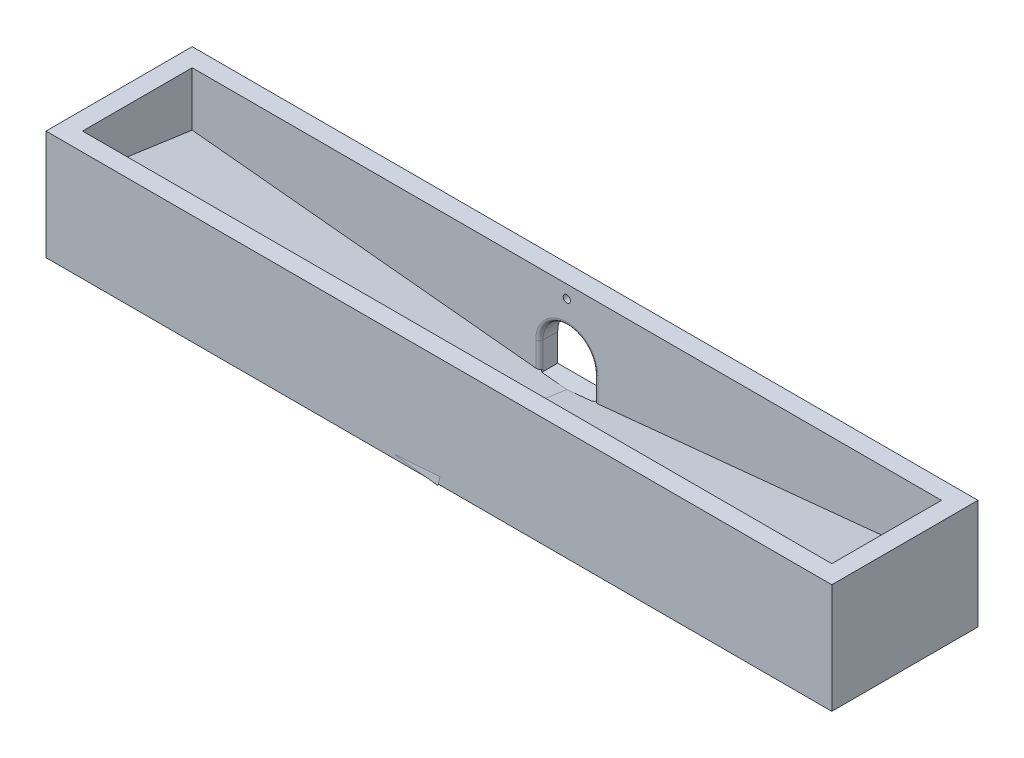
ISO-10303-21;
HEADER;
FILE_DESCRIPTION(('STEP AP214'),'2;1');
FILE_NAME('part.step','',(''),(''),'','','');
FILE_SCHEMA(('AUTOMOTIVE_DESIGN { 1 0 10303 214 1 1 1 1 }'));
ENDSEC;
DATA;
#1=APPLICATION_CONTEXT('core data for automotive mechanical design processes');
#2=APPLICATION_PROTOCOL_DEFINITION('international standard','automotive_design',2000,#1);
#3=PRODUCT_CONTEXT('',#1,'mechanical');
#4=PRODUCT('Part','Part','',(#3));
#5=PRODUCT_RELATED_PRODUCT_CATEGORY('part','',(#4));
#6=PRODUCT_DEFINITION_FORMATION('','',#4);
#7=PRODUCT_DEFINITION_CONTEXT('part definition',#1,'design');
#8=PRODUCT_DEFINITION('design','',#6,#7);
#9=PRODUCT_DEFINITION_SHAPE('','',#8);
#10=(LENGTH_UNIT() NAMED_UNIT(*) SI_UNIT(.MILLI.,.METRE.));
#11=(NAMED_UNIT(*) PLANE_ANGLE_UNIT() SI_UNIT($,.RADIAN.));
#12=(NAMED_UNIT(*) SI_UNIT($,.STERADIAN.) SOLID_ANGLE_UNIT());
#13=UNCERTAINTY_MEASURE_WITH_UNIT(LENGTH_MEASURE(1.E-05),#10,'distance_accuracy_value','');
#14=(GEOMETRIC_REPRESENTATION_CONTEXT(3) GLOBAL_UNCERTAINTY_ASSIGNED_CONTEXT((#13)) GLOBAL_UNIT_ASSIGNED_CONTEXT((#10,
#11,#12)) REPRESENTATION_CONTEXT('',''));
#15=CARTESIAN_POINT('',(0.,0.,0.));
#16=DIRECTION('',(0.,0.,1.));
#17=DIRECTION('',(1.,0.,0.));
#18=AXIS2_PLACEMENT_3D('',#15,#16,#17);
#19=CARTESIAN_POINT('',(5.04655087616473,33.5218987841965,80.));
#20=DIRECTION('',(-0.010162979171878,0.142406644594665,0.98975606157762));
#21=DIRECTION('',(-0.997463139995083,-0.0711848604068987,0.));
#22=AXIS2_PLACEMENT_3D('',#19,#20,#21);
#23=PLANE('',#22);
#24=DIRECTION('',(-0.997463139995083,-0.0711848604068987,0.));
#25=VECTOR('',#24,1.);
#26=CARTESIAN_POINT('',(-7.55437981327096,32.6226219526447,80.));
#27=LINE('',#26,#25);
#28=CARTESIAN_POINT('',(5.04655087616473,33.5218987841965,80.));
#29=VERTEX_POINT('',#28);
#30=CARTESIAN_POINT('',(-20.1553105027066,31.7233451210929,80.));
#31=VERTEX_POINT('',#30);
#32=EDGE_CURVE('E13',#29,#31,#27,.T.);
#33=ORIENTED_EDGE('',*,*,#32,.T.);
#34=DIRECTION('',(0.995115861768251,-0.0957531220203229,0.0239950261635971));
#35=VECTOR('',#34,1.);
#36=CARTESIAN_POINT('',(-7.76285659323286,30.530904927027,80.2988167179454));
#37=LINE('',#36,#35);
#38=CARTESIAN_POINT('',(4.62959731624092,29.338464732961,80.5976334358908));
#39=VERTEX_POINT('',#38);
#40=EDGE_CURVE('E70',#31,#39,#37,.T.);
#41=ORIENTED_EDGE('',*,*,#40,.T.);
#42=DIRECTION('',(0.0981892840971753,0.985165817108325,-0.140737973872618));
#43=VECTOR('',#42,1.);
#44=CARTESIAN_POINT('',(4.83807409620283,31.4301817585788,80.2988167179454));
#45=LINE('',#44,#43);
#46=EDGE_CURVE('E65',#39,#29,#45,.T.);
#47=ORIENTED_EDGE('',*,*,#46,.T.);
#48=EDGE_LOOP('',(#33,#41,#47));
#49=FACE_BOUND('',#48,.T.);
#50=ADVANCED_FACE('F64',(#49),#23,.T.);
#51=OPEN_SHELL('',(#50));
#52=SHELL_BASED_SURFACE_MODEL('B2',(#51));
#53=CARTESIAN_POINT('',(-210.490943755958,29.5662535748332,80.));
#54=DIRECTION('',(0.,1.,0.));
#55=DIRECTION('',(0.,0.,1.));
#56=AXIS2_PLACEMENT_3D('',#53,#54,#55);
#57=PLANE('',#56);
#58=DIRECTION('',(0.,0.,1.));
#59=VECTOR('',#58,1.);
#60=CARTESIAN_POINT('',(26.8697360190398,29.5662535748332,10.));
#61=LINE('',#60,#59);
#62=CARTESIAN_POINT('',(26.8697360190398,29.5662535748332,0.));
#63=VERTEX_POINT('',#62);
#64=CARTESIAN_POINT('',(26.8697360190398,29.5662535748332,10.));
#65=VERTEX_POINT('',#64);
#66=EDGE_CURVE('E118',#63,#65,#61,.T.);
#67=ORIENTED_EDGE('',*,*,#66,.F.);
#68=DIRECTION('',(1.,0.,0.));
#69=VECTOR('',#68,1.);
#70=CARTESIAN_POINT('',(-210.490943755958,29.5662535748332,0.));
#71=LINE('',#70,#69);
#72=CARTESIAN_POINT('',(219.509056244042,29.5662535748332,0.));
#73=VERTEX_POINT('',#72);
#74=EDGE_CURVE('E350',#63,#73,#71,.T.);
#75=ORIENTED_EDGE('',*,*,#74,.T.);
#76=DIRECTION('',(0.,0.,-1.));
#77=VECTOR('',#76,1.);
#78=CARTESIAN_POINT('',(219.509056244042,29.5662535748332,80.));
#79=LINE('',#78,#77);
#80=CARTESIAN_POINT('',(219.509056244042,29.5662535748332,80.));
#81=VERTEX_POINT('',#80);
#82=EDGE_CURVE('E361',#81,#73,#79,.T.);
#83=ORIENTED_EDGE('',*,*,#82,.F.);
#84=DIRECTION('',(1.,0.,0.));
#85=VECTOR('',#84,1.);
#86=CARTESIAN_POINT('',(-210.490943755958,29.5662535748332,80.));
#87=LINE('',#86,#85);
#88=CARTESIAN_POINT('',(-210.490943755958,29.5662535748332,80.));
#89=VERTEX_POINT('',#88);
#90=EDGE_CURVE('E340',#89,#81,#87,.T.);
#91=ORIENTED_EDGE('',*,*,#90,.F.);
#92=DIRECTION('',(0.,0.,-1.));
#93=VECTOR('',#92,1.);
#94=CARTESIAN_POINT('',(-210.490943755958,29.5662535748332,80.));
#95=LINE('',#94,#93);
#96=CARTESIAN_POINT('',(-210.490943755958,29.5662535748332,0.));
#97=VERTEX_POINT('',#96);
#98=EDGE_CURVE('E364',#89,#97,#95,.T.);
#99=ORIENTED_EDGE('',*,*,#98,.T.);
#100=CARTESIAN_POINT('',(-17.851623530956,29.5662535748332,0.));
#101=VERTEX_POINT('',#100);
#102=EDGE_CURVE('E351',#97,#101,#71,.T.);
#103=ORIENTED_EDGE('',*,*,#102,.T.);
#104=DIRECTION('',(0.,0.,-1.));
#105=VECTOR('',#104,1.);
#106=CARTESIAN_POINT('',(-17.851623530956,29.5662535748332,0.));
#107=LINE('',#106,#105);
#108=CARTESIAN_POINT('',(-17.851623530956,29.5662535748332,10.));
#109=VERTEX_POINT('',#108);
#110=EDGE_CURVE('E263',#109,#101,#107,.T.);
#111=ORIENTED_EDGE('',*,*,#110,.F.);
#112=DIRECTION('',(-1.,0.,0.));
#113=VECTOR('',#112,1.);
#114=CARTESIAN_POINT('',(-17.851623530956,29.5662535748332,10.));
#115=LINE('',#114,#113);
#116=EDGE_CURVE('E113',#65,#109,#115,.T.);
#117=ORIENTED_EDGE('',*,*,#116,.F.);
#118=EDGE_LOOP('',(#67,#75,#83,#91,#99,#103,#111,#117));
#119=FACE_BOUND('',#118,.T.);
#120=ADVANCED_FACE('F98',(#119),#57,.F.);
#121=CARTESIAN_POINT('',(-200.490943755958,39.5662535748332,10.));
#122=DIRECTION('',(0.,0.,-1.));
#123=DIRECTION('',(-1.,0.,0.));
#124=AXIS2_PLACEMENT_3D('',#121,#122,#123);
#125=PLANE('',#124);
#126=CARTESIAN_POINT('',(4.50905624404191,82.5662535748332,10.));
#127=DIRECTION('',(0.,0.,-1.));
#128=DIRECTION('',(-1.,0.,0.));
#129=AXIS2_PLACEMENT_3D('',#126,#127,#128);
#130=CIRCLE('',#129,2.);
#131=CARTESIAN_POINT('',(2.50905624404191,82.5662535748332,10.));
#132=VERTEX_POINT('',#131);
#133=EDGE_CURVE('E518',#132,#132,#130,.T.);
#134=ORIENTED_EDGE('',*,*,#133,.T.);
#135=EDGE_LOOP('',(#134));
#136=FACE_BOUND('',#135,.T.);
#137=DIRECTION('',(-0.995069867860061,0.0991763987900393,0.));
#138=VECTOR('',#137,1.);
#139=CARTESIAN_POINT('',(-198.474572350181,59.7971800127956,10.));
#140=LINE('',#139,#138);
#141=CARTESIAN_POINT('',(-12.4909437559582,41.2606057343016,10.));
#142=VERTEX_POINT('',#141);
#143=CARTESIAN_POINT('',(-200.490943755958,59.9981472625408,10.));
#144=VERTEX_POINT('',#143);
#145=EDGE_CURVE('E312',#142,#144,#140,.T.);
#146=ORIENTED_EDGE('',*,*,#145,.F.);
#147=DIRECTION('',(0.,1.,0.));
#148=VECTOR('',#147,1.);
#149=CARTESIAN_POINT('',(-12.4909437559581,39.5662535748332,10.));
#150=LINE('',#149,#148);
#151=CARTESIAN_POINT('',(-12.4909437559581,54.5662535748332,10.));
#152=VERTEX_POINT('',#151);
#153=EDGE_CURVE('E377',#142,#152,#150,.T.);
#154=ORIENTED_EDGE('',*,*,#153,.T.);
#155=CARTESIAN_POINT('',(4.50905624404187,54.5662535748332,10.));
#156=DIRECTION('',(0.,0.,-1.));
#157=DIRECTION('',(-1.,0.,0.));
#158=AXIS2_PLACEMENT_3D('',#155,#156,#157);
#159=CIRCLE('',#158,17.);
#160=CARTESIAN_POINT('',(21.5090562440419,54.5662535748332,10.));
#161=VERTEX_POINT('',#160);
#162=EDGE_CURVE('E375',#152,#161,#159,.T.);
#163=ORIENTED_EDGE('',*,*,#162,.T.);
#164=DIRECTION('',(0.,-1.,0.));
#165=VECTOR('',#164,1.);
#166=CARTESIAN_POINT('',(21.5090562440419,39.5662535748332,10.));
#167=LINE('',#166,#165);
#168=CARTESIAN_POINT('',(21.5090562440418,41.2606057343016,10.));
#169=VERTEX_POINT('',#168);
#170=EDGE_CURVE('E373',#161,#169,#167,.T.);
#171=ORIENTED_EDGE('',*,*,#170,.T.);
#172=DIRECTION('',(-0.995069867860061,-0.0991763987900384,0.));
#173=VECTOR('',#172,1.);
#174=CARTESIAN_POINT('',(-198.474572350181,19.3353271368709,10.));
#175=LINE('',#174,#173);
#176=CARTESIAN_POINT('',(209.509056244042,59.9981472625406,10.));
#177=VERTEX_POINT('',#176);
#178=EDGE_CURVE('E304',#177,#169,#175,.T.);
#179=ORIENTED_EDGE('',*,*,#178,.F.);
#180=DIRECTION('',(0.,1.,0.));
#181=VECTOR('',#180,1.);
#182=CARTESIAN_POINT('',(209.509056244042,39.5662535748332,10.));
#183=LINE('',#182,#181);
#184=CARTESIAN_POINT('',(209.509056244042,89.5662535748332,10.));
#185=VERTEX_POINT('',#184);
#186=EDGE_CURVE('E332',#177,#185,#183,.T.);
#187=ORIENTED_EDGE('',*,*,#186,.T.);
#188=DIRECTION('',(-1.,0.,0.));
#189=VECTOR('',#188,1.);
#190=CARTESIAN_POINT('',(-200.490943755958,89.5662535748332,10.));
#191=LINE('',#190,#189);
#192=CARTESIAN_POINT('',(-200.490943755958,89.5662535748332,10.));
#193=VERTEX_POINT('',#192);
#194=EDGE_CURVE('E325',#185,#193,#191,.T.);
#195=ORIENTED_EDGE('',*,*,#194,.T.);
#196=DIRECTION('',(0.,1.,0.));
#197=VECTOR('',#196,1.);
#198=CARTESIAN_POINT('',(-200.490943755958,39.5662535748332,10.));
#199=LINE('',#198,#197);
#200=EDGE_CURVE('E329',#144,#193,#199,.T.);
#201=ORIENTED_EDGE('',*,*,#200,.F.);
#202=EDGE_LOOP('',(#146,#154,#163,#171,#179,#187,#195,#201));
#203=FACE_BOUND('',#202,.T.);
#204=ADVANCED_FACE('F464',(#136,#203),#125,.F.);
#205=CARTESIAN_POINT('',(0.,0.,80.));
#206=DIRECTION('',(0.,0.,1.));
#207=DIRECTION('',(1.,0.,0.));
#208=AXIS2_PLACEMENT_3D('',#205,#206,#207);
#209=PLANE('',#208);
#210=ORIENTED_EDGE('',*,*,#90,.T.);
#211=DIRECTION('',(0.,1.,0.));
#212=VECTOR('',#211,1.);
#213=CARTESIAN_POINT('',(219.509056244042,89.5662535748332,80.));
#214=LINE('',#213,#212);
#215=CARTESIAN_POINT('',(219.509056244042,89.5662535748332,80.));
#216=VERTEX_POINT('',#215);
#217=EDGE_CURVE('E343',#81,#216,#214,.T.);
#218=ORIENTED_EDGE('',*,*,#217,.T.);
#219=DIRECTION('',(-1.,0.,0.));
#220=VECTOR('',#219,1.);
#221=CARTESIAN_POINT('',(-210.490943755958,89.5662535748332,80.));
#222=LINE('',#221,#220);
#223=CARTESIAN_POINT('',(-210.490943755958,89.5662535748332,80.));
#224=VERTEX_POINT('',#223);
#225=EDGE_CURVE('E345',#216,#224,#222,.T.);
#226=ORIENTED_EDGE('',*,*,#225,.T.);
#227=DIRECTION('',(0.,-1.,0.));
#228=VECTOR('',#227,1.);
#229=CARTESIAN_POINT('',(-210.490943755958,89.5662535748332,80.));
#230=LINE('',#229,#228);
#231=EDGE_CURVE('E337',#224,#89,#230,.T.);
#232=ORIENTED_EDGE('',*,*,#231,.T.);
#233=EDGE_LOOP('',(#210,#218,#226,#232));
#234=FACE_BOUND('',#233,.T.);
#235=ADVANCED_FACE('F504',(#234),#209,.T.);
#236=CARTESIAN_POINT('',(209.509056244042,39.5662535748332,10.));
#237=DIRECTION('',(1.,0.,0.));
#238=DIRECTION('',(0.,0.,-1.));
#239=AXIS2_PLACEMENT_3D('',#236,#237,#238);
#240=PLANE('',#239);
#241=DIRECTION('',(0.,-0.14142135623731,-0.989949493661166));
#242=VECTOR('',#241,1.);
#243=CARTESIAN_POINT('',(209.509056244042,59.5895093887865,7.13953488372095));
#244=LINE('',#243,#242);
#245=CARTESIAN_POINT('',(209.509056244042,68.5695758339693,70.));
#246=VERTEX_POINT('',#245);
#247=EDGE_CURVE('E300',#246,#177,#244,.T.);
#248=ORIENTED_EDGE('',*,*,#247,.F.);
#249=DIRECTION('',(0.,1.,0.));
#250=VECTOR('',#249,1.);
#251=CARTESIAN_POINT('',(209.509056244042,39.5662535748332,70.));
#252=LINE('',#251,#250);
#253=CARTESIAN_POINT('',(209.509056244042,89.5662535748332,70.));
#254=VERTEX_POINT('',#253);
#255=EDGE_CURVE('E334',#246,#254,#252,.T.);
#256=ORIENTED_EDGE('',*,*,#255,.T.);
#257=DIRECTION('',(0.,0.,-1.));
#258=VECTOR('',#257,1.);
#259=CARTESIAN_POINT('',(209.509056244042,89.5662535748332,10.));
#260=LINE('',#259,#258);
#261=EDGE_CURVE('E322',#254,#185,#260,.T.);
#262=ORIENTED_EDGE('',*,*,#261,.T.);
#263=ORIENTED_EDGE('',*,*,#186,.F.);
#264=EDGE_LOOP('',(#248,#256,#262,#263));
#265=FACE_BOUND('',#264,.T.);
#266=ADVANCED_FACE('F459',(#265),#240,.F.);
#267=CARTESIAN_POINT('',(-200.490943755958,39.5662535748332,70.));
#268=DIRECTION('',(0.,0.,1.));
#269=DIRECTION('',(1.,0.,0.));
#270=AXIS2_PLACEMENT_3D('',#267,#268,#269);
#271=PLANE('',#270);
#272=DIRECTION('',(0.995069867860061,0.0991763987900384,0.));
#273=VECTOR('',#272,1.);
#274=CARTESIAN_POINT('',(-199.3204647448,27.8224474962113,70.));
#275=LINE('',#274,#273);
#276=CARTESIAN_POINT('',(4.50905624404194,48.1376821462618,70.));
#277=VERTEX_POINT('',#276);
#278=EDGE_CURVE('E297',#277,#246,#275,.T.);
#279=ORIENTED_EDGE('',*,*,#278,.F.);
#280=DIRECTION('',(0.995069867860061,-0.0991763987900393,0.));
#281=VECTOR('',#280,1.);
#282=CARTESIAN_POINT('',(-197.628679955562,68.284300372136,70.));
#283=LINE('',#282,#281);
#284=CARTESIAN_POINT('',(-200.490943755958,68.5695758339694,70.));
#285=VERTEX_POINT('',#284);
#286=EDGE_CURVE('E307',#285,#277,#283,.T.);
#287=ORIENTED_EDGE('',*,*,#286,.F.);
#288=DIRECTION('',(0.,1.,0.));
#289=VECTOR('',#288,1.);
#290=CARTESIAN_POINT('',(-200.490943755958,39.5662535748332,70.));
#291=LINE('',#290,#289);
#292=CARTESIAN_POINT('',(-200.490943755958,89.5662535748332,70.));
#293=VERTEX_POINT('',#292);
#294=EDGE_CURVE('E328',#285,#293,#291,.T.);
#295=ORIENTED_EDGE('',*,*,#294,.T.);
#296=DIRECTION('',(1.,0.,0.));
#297=VECTOR('',#296,1.);
#298=CARTESIAN_POINT('',(-200.490943755958,89.5662535748332,70.));
#299=LINE('',#298,#297);
#300=EDGE_CURVE('E319',#293,#254,#299,.T.);
#301=ORIENTED_EDGE('',*,*,#300,.T.);
#302=ORIENTED_EDGE('',*,*,#255,.F.);
#303=EDGE_LOOP('',(#279,#287,#295,#301,#302));
#304=FACE_BOUND('',#303,.T.);
#305=ADVANCED_FACE('F454',(#304),#271,.F.);
#306=CARTESIAN_POINT('',(3.73263439100569,37.4507650564238,-5.35010929377485));
#307=DIRECTION('',(-0.0981892840971753,-0.985165817108325,0.140737973872618));
#308=DIRECTION('',(0.,-0.14142135623731,-0.989949493661166));
#309=AXIS2_PLACEMENT_3D('',#306,#307,#308);
#310=PLANE('',#309);
#311=DIRECTION('',(0.,0.14142135623731,0.989949493661166));
#312=VECTOR('',#311,1.);
#313=CARTESIAN_POINT('',(4.50905624404194,37.3749285033365,-5.33927550047666));
#314=LINE('',#313,#312);
#315=CARTESIAN_POINT('',(4.50905624404187,39.5662535748332,10.));
#316=VERTEX_POINT('',#315);
#317=EDGE_CURVE('E367',#316,#277,#314,.T.);
#318=ORIENTED_EDGE('',*,*,#317,.F.);
#319=CARTESIAN_POINT('',(-8.49094375595819,40.8619346379561,10.));
#320=VERTEX_POINT('',#319);
#321=EDGE_CURVE('E313',#316,#320,#140,.T.);
#322=ORIENTED_EDGE('',*,*,#321,.T.);
#323=CARTESIAN_POINT('',(-8.49094375595813,40.5762203522418,8.));
#324=DIRECTION('',(-0.0981892840971753,-0.985165817108325,0.140737973872618));
#325=DIRECTION('',(0.563693749581408,-0.171605107153854,-0.807961041066688));
#326=AXIS2_PLACEMENT_3D('',#323,#324,#325);
#327=ELLIPSE('',#326,2.03011509866474,2.);
#328=CARTESIAN_POINT('',(-10.4909437559581,40.7755559004146,8.));
#329=VERTEX_POINT('',#328);
#330=EDGE_CURVE('E62',#320,#329,#327,.T.);
#331=ORIENTED_EDGE('',*,*,#330,.T.);
#332=CARTESIAN_POINT('',(-12.4909437559581,40.9748914485873,8.));
#333=DIRECTION('',(-0.0981892840971753,-0.985165817108325,0.140737973872618));
#334=DIRECTION('',(-0.563693749581408,0.171605107153854,0.807961041066688));
#335=AXIS2_PLACEMENT_3D('',#332,#333,#334);
#336=ELLIPSE('',#335,2.03011509866474,2.);
#337=EDGE_CURVE('E384',#329,#142,#336,.T.);
#338=ORIENTED_EDGE('',*,*,#337,.T.);
#339=ORIENTED_EDGE('',*,*,#145,.T.);
#340=DIRECTION('',(0.,0.14142135623731,0.989949493661166));
#341=VECTOR('',#340,1.);
#342=CARTESIAN_POINT('',(-200.490943755958,59.5895093887867,7.13953488372092));
#343=LINE('',#342,#341);
#344=EDGE_CURVE('E309',#144,#285,#343,.T.);
#345=ORIENTED_EDGE('',*,*,#344,.T.);
#346=ORIENTED_EDGE('',*,*,#286,.T.);
#347=EDGE_LOOP('',(#318,#322,#331,#338,#339,#345,#346));
#348=FACE_BOUND('',#347,.T.);
#349=ADVANCED_FACE('F450',(#348),#310,.F.);
#350=CARTESIAN_POINT('',(-200.490943755958,39.5662535748332,10.));
#351=DIRECTION('',(-1.,0.,0.));
#352=DIRECTION('',(0.,0.,1.));
#353=AXIS2_PLACEMENT_3D('',#350,#351,#352);
#354=PLANE('',#353);
#355=ORIENTED_EDGE('',*,*,#344,.F.);
#356=ORIENTED_EDGE('',*,*,#200,.T.);
#357=DIRECTION('',(0.,0.,1.));
#358=VECTOR('',#357,1.);
#359=CARTESIAN_POINT('',(-200.490943755958,89.5662535748332,10.));
#360=LINE('',#359,#358);
#361=EDGE_CURVE('E316',#193,#293,#360,.T.);
#362=ORIENTED_EDGE('',*,*,#361,.T.);
#363=ORIENTED_EDGE('',*,*,#294,.F.);
#364=EDGE_LOOP('',(#355,#356,#362,#363));
#365=FACE_BOUND('',#364,.T.);
#366=ADVANCED_FACE('F481',(#365),#354,.F.);
#367=CARTESIAN_POINT('',(-210.490943755958,89.5662535748332,80.));
#368=DIRECTION('',(1.,0.,0.));
#369=DIRECTION('',(0.,1.,0.));
#370=AXIS2_PLACEMENT_3D('',#367,#368,#369);
#371=PLANE('',#370);
#372=DIRECTION('',(0.,-1.,0.));
#373=VECTOR('',#372,1.);
#374=CARTESIAN_POINT('',(-210.490943755958,89.5662535748332,0.));
#375=LINE('',#374,#373);
#376=CARTESIAN_POINT('',(-210.490943755958,89.5662535748332,0.));
#377=VERTEX_POINT('',#376);
#378=EDGE_CURVE('E331',#377,#97,#375,.T.);
#379=ORIENTED_EDGE('',*,*,#378,.T.);
#380=ORIENTED_EDGE('',*,*,#98,.F.);
#381=ORIENTED_EDGE('',*,*,#231,.F.);
#382=DIRECTION('',(0.,0.,-1.));
#383=VECTOR('',#382,1.);
#384=CARTESIAN_POINT('',(-210.490943755958,89.5662535748332,80.));
#385=LINE('',#384,#383);
#386=EDGE_CURVE('E347',#224,#377,#385,.T.);
#387=ORIENTED_EDGE('',*,*,#386,.T.);
#388=EDGE_LOOP('',(#379,#380,#381,#387));
#389=FACE_BOUND('',#388,.T.);
#390=ADVANCED_FACE('F496',(#389),#371,.F.);
#391=CARTESIAN_POINT('',(219.509056244042,89.5662535748332,80.));
#392=DIRECTION('',(-1.,0.,0.));
#393=DIRECTION('',(0.,-1.,0.));
#394=AXIS2_PLACEMENT_3D('',#391,#392,#393);
#395=PLANE('',#394);
#396=DIRECTION('',(0.,1.,0.));
#397=VECTOR('',#396,1.);
#398=CARTESIAN_POINT('',(219.509056244042,89.5662535748332,0.));
#399=LINE('',#398,#397);
#400=CARTESIAN_POINT('',(219.509056244042,89.5662535748332,0.));
#401=VERTEX_POINT('',#400);
#402=EDGE_CURVE('E353',#73,#401,#399,.T.);
#403=ORIENTED_EDGE('',*,*,#402,.T.);
#404=DIRECTION('',(0.,0.,-1.));
#405=VECTOR('',#404,1.);
#406=CARTESIAN_POINT('',(219.509056244042,89.5662535748332,80.));
#407=LINE('',#406,#405);
#408=EDGE_CURVE('E358',#216,#401,#407,.T.);
#409=ORIENTED_EDGE('',*,*,#408,.F.);
#410=ORIENTED_EDGE('',*,*,#217,.F.);
#411=ORIENTED_EDGE('',*,*,#82,.T.);
#412=EDGE_LOOP('',(#403,#409,#410,#411));
#413=FACE_BOUND('',#412,.T.);
#414=ADVANCED_FACE('F486',(#413),#395,.F.);
#415=CARTESIAN_POINT('',(-210.490943755958,89.5662535748332,80.));
#416=DIRECTION('',(0.,-1.,0.));
#417=DIRECTION('',(0.,0.,-1.));
#418=AXIS2_PLACEMENT_3D('',#415,#416,#417);
#419=PLANE('',#418);
#420=ORIENTED_EDGE('',*,*,#300,.F.);
#421=ORIENTED_EDGE('',*,*,#361,.F.);
#422=ORIENTED_EDGE('',*,*,#194,.F.);
#423=ORIENTED_EDGE('',*,*,#261,.F.);
#424=EDGE_LOOP('',(#420,#421,#422,#423));
#425=FACE_BOUND('',#424,.T.);
#426=DIRECTION('',(-1.,0.,0.));
#427=VECTOR('',#426,1.);
#428=CARTESIAN_POINT('',(-210.490943755958,89.5662535748332,0.));
#429=LINE('',#428,#427);
#430=EDGE_CURVE('E341',#401,#377,#429,.T.);
#431=ORIENTED_EDGE('',*,*,#430,.T.);
#432=ORIENTED_EDGE('',*,*,#386,.F.);
#433=ORIENTED_EDGE('',*,*,#225,.F.);
#434=ORIENTED_EDGE('',*,*,#408,.T.);
#435=EDGE_LOOP('',(#431,#432,#433,#434));
#436=FACE_BOUND('',#435,.T.);
#437=ADVANCED_FACE('F483',(#425,#436),#419,.F.);
#438=CARTESIAN_POINT('',(0.,0.,0.));
#439=DIRECTION('',(0.,0.,1.));
#440=DIRECTION('',(1.,0.,0.));
#441=AXIS2_PLACEMENT_3D('',#438,#439,#440);
#442=PLANE('',#441);
#443=CARTESIAN_POINT('',(4.50905624404191,82.5662535748332,0.));
#444=DIRECTION('',(0.,0.,-1.));
#445=DIRECTION('',(-1.,0.,0.));
#446=AXIS2_PLACEMENT_3D('',#443,#444,#445);
#447=CIRCLE('',#446,2.);
#448=CARTESIAN_POINT('',(2.50905624404191,82.5662535748332,0.));
#449=VERTEX_POINT('',#448);
#450=EDGE_CURVE('E521',#449,#449,#447,.T.);
#451=ORIENTED_EDGE('',*,*,#450,.F.);
#452=EDGE_LOOP('',(#451));
#453=FACE_BOUND('',#452,.T.);
#454=CARTESIAN_POINT('',(4.5090562440419,24.5662535748332,0.));
#455=DIRECTION('',(0.,0.,-1.));
#456=DIRECTION('',(-1.,0.,0.));
#457=AXIS2_PLACEMENT_3D('',#454,#455,#456);
#458=CIRCLE('',#457,2.);
#459=CARTESIAN_POINT('',(2.5090562440419,24.5662535748332,0.));
#460=VERTEX_POINT('',#459);
#461=EDGE_CURVE('E515',#460,#460,#458,.T.);
#462=ORIENTED_EDGE('',*,*,#461,.F.);
#463=EDGE_LOOP('',(#462));
#464=FACE_BOUND('',#463,.T.);
#465=CARTESIAN_POINT('',(4.50905624404187,54.5662535748332,0.));
#466=DIRECTION('',(0.,0.,1.));
#467=DIRECTION('',(1.,0.,0.));
#468=AXIS2_PLACEMENT_3D('',#465,#466,#467);
#469=CIRCLE('',#468,15.);
#470=CARTESIAN_POINT('',(19.5090562440419,54.5662535748332,0.));
#471=VERTEX_POINT('',#470);
#472=CARTESIAN_POINT('',(-10.4909437559581,54.5662535748332,0.));
#473=VERTEX_POINT('',#472);
#474=EDGE_CURVE('E289',#471,#473,#469,.T.);
#475=ORIENTED_EDGE('',*,*,#474,.T.);
#476=DIRECTION('',(0.,1.,0.));
#477=VECTOR('',#476,1.);
#478=CARTESIAN_POINT('',(-10.4909437559581,39.5662535748332,0.));
#479=LINE('',#478,#477);
#480=CARTESIAN_POINT('',(-10.4909437559581,39.5662535748332,0.));
#481=VERTEX_POINT('',#480);
#482=EDGE_CURVE('E284',#481,#473,#479,.T.);
#483=ORIENTED_EDGE('',*,*,#482,.F.);
#484=DIRECTION('',(-1.,0.,0.));
#485=VECTOR('',#484,1.);
#486=CARTESIAN_POINT('',(4.50905624404187,39.5662535748332,0.));
#487=LINE('',#486,#485);
#488=CARTESIAN_POINT('',(19.5090562440419,39.5662535748332,0.));
#489=VERTEX_POINT('',#488);
#490=EDGE_CURVE('E281',#489,#481,#487,.T.);
#491=ORIENTED_EDGE('',*,*,#490,.F.);
#492=DIRECTION('',(0.,-1.,0.));
#493=VECTOR('',#492,1.);
#494=CARTESIAN_POINT('',(19.5090562440419,54.5662535748332,0.));
#495=LINE('',#494,#493);
#496=EDGE_CURVE('E278',#471,#489,#495,.T.);
#497=ORIENTED_EDGE('',*,*,#496,.F.);
#498=EDGE_LOOP('',(#475,#483,#491,#497));
#499=FACE_BOUND('',#498,.T.);
#500=ORIENTED_EDGE('',*,*,#378,.F.);
#501=ORIENTED_EDGE('',*,*,#430,.F.);
#502=ORIENTED_EDGE('',*,*,#402,.F.);
#503=ORIENTED_EDGE('',*,*,#74,.F.);
#504=DIRECTION('',(0.,1.,0.));
#505=VECTOR('',#504,1.);
#506=CARTESIAN_POINT('',(26.8697360190398,19.5662535748332,0.));
#507=LINE('',#506,#505);
#508=CARTESIAN_POINT('',(26.8697360190398,19.5662535748332,0.));
#509=VERTEX_POINT('',#508);
#510=EDGE_CURVE('E506',#509,#63,#507,.T.);
#511=ORIENTED_EDGE('',*,*,#510,.F.);
#512=DIRECTION('',(1.,0.,0.));
#513=VECTOR('',#512,1.);
#514=CARTESIAN_POINT('',(26.8697360190398,19.5662535748332,0.));
#515=LINE('',#514,#513);
#516=CARTESIAN_POINT('',(-17.851623530956,19.5662535748332,0.));
#517=VERTEX_POINT('',#516);
#518=EDGE_CURVE('E259',#517,#509,#515,.T.);
#519=ORIENTED_EDGE('',*,*,#518,.F.);
#520=DIRECTION('',(0.,1.,0.));
#521=VECTOR('',#520,1.);
#522=CARTESIAN_POINT('',(-17.851623530956,19.5662535748332,0.));
#523=LINE('',#522,#521);
#524=EDGE_CURVE('E270',#517,#101,#523,.T.);
#525=ORIENTED_EDGE('',*,*,#524,.T.);
#526=ORIENTED_EDGE('',*,*,#102,.F.);
#527=EDGE_LOOP('',(#500,#501,#502,#503,#511,#519,#525,#526));
#528=FACE_BOUND('',#527,.T.);
#529=ADVANCED_FACE('F429',(#453,#464,#499,#528),#442,.F.);
#530=CARTESIAN_POINT('',(5.28547809707813,37.4507650564238,-5.35010929377485));
#531=DIRECTION('',(0.0981892840971744,-0.985165817108326,0.140737973872618));
#532=DIRECTION('',(0.,-0.14142135623731,-0.989949493661166));
#533=AXIS2_PLACEMENT_3D('',#530,#531,#532);
#534=PLANE('',#533);
#535=ORIENTED_EDGE('',*,*,#247,.T.);
#536=ORIENTED_EDGE('',*,*,#178,.T.);
#537=CARTESIAN_POINT('',(21.5090562440419,40.9748914485873,8.));
#538=DIRECTION('',(0.0981892840971744,-0.985165817108326,0.140737973872618));
#539=DIRECTION('',(-0.563693749581405,-0.171605107153853,-0.807961041066691));
#540=AXIS2_PLACEMENT_3D('',#537,#538,#539);
#541=ELLIPSE('',#540,2.03011509866474,2.);
#542=CARTESIAN_POINT('',(19.5090562440419,40.7755559004146,8.));
#543=VERTEX_POINT('',#542);
#544=EDGE_CURVE('E386',#169,#543,#541,.T.);
#545=ORIENTED_EDGE('',*,*,#544,.T.);
#546=CARTESIAN_POINT('',(17.5090562440419,40.5762203522418,8.));
#547=DIRECTION('',(0.0981892840971744,-0.985165817108326,0.140737973872618));
#548=DIRECTION('',(0.563693749581405,0.171605107153853,0.807961041066691));
#549=AXIS2_PLACEMENT_3D('',#546,#547,#548);
#550=ELLIPSE('',#549,2.03011509866474,2.);
#551=CARTESIAN_POINT('',(17.5090562440418,40.8619346379561,10.));
#552=VERTEX_POINT('',#551);
#553=EDGE_CURVE('E106',#543,#552,#550,.T.);
#554=ORIENTED_EDGE('',*,*,#553,.T.);
#555=EDGE_CURVE('E303',#552,#316,#175,.T.);
#556=ORIENTED_EDGE('',*,*,#555,.T.);
#557=ORIENTED_EDGE('',*,*,#317,.T.);
#558=ORIENTED_EDGE('',*,*,#278,.T.);
#559=EDGE_LOOP('',(#535,#536,#545,#554,#556,#557,#558));
#560=FACE_BOUND('',#559,.T.);
#561=ADVANCED_FACE('F408',(#560),#534,.F.);
#562=CARTESIAN_POINT('',(4.50905624404187,54.5662535748332,-70.));
#563=DIRECTION('',(0.,0.,1.));
#564=DIRECTION('',(1.,0.,0.));
#565=AXIS2_PLACEMENT_3D('',#562,#563,#564);
#566=CYLINDRICAL_SURFACE('',#565,15.);
#567=DIRECTION('',(0.,0.,-1.));
#568=VECTOR('',#567,1.);
#569=CARTESIAN_POINT('',(19.5090562440419,54.5662535748332,10.));
#570=LINE('',#569,#568);
#571=CARTESIAN_POINT('',(19.5090562440419,54.5662535748332,8.));
#572=VERTEX_POINT('',#571);
#573=EDGE_CURVE('E276',#572,#471,#570,.T.);
#574=ORIENTED_EDGE('',*,*,#573,.F.);
#575=CARTESIAN_POINT('',(4.50905624404187,54.5662535748332,8.00000000000001));
#576=DIRECTION('',(0.,0.,-1.));
#577=DIRECTION('',(-1.,0.,0.));
#578=AXIS2_PLACEMENT_3D('',#575,#576,#577);
#579=CIRCLE('',#578,15.);
#580=CARTESIAN_POINT('',(-10.4909437559581,54.5662535748332,8.));
#581=VERTEX_POINT('',#580);
#582=EDGE_CURVE('E370',#572,#581,#579,.F.);
#583=ORIENTED_EDGE('',*,*,#582,.T.);
#584=DIRECTION('',(0.,0.,-1.));
#585=VECTOR('',#584,1.);
#586=CARTESIAN_POINT('',(-10.4909437559581,54.5662535748332,10.));
#587=LINE('',#586,#585);
#588=EDGE_CURVE('E287',#581,#473,#587,.T.);
#589=ORIENTED_EDGE('',*,*,#588,.T.);
#590=ORIENTED_EDGE('',*,*,#474,.F.);
#591=EDGE_LOOP('',(#574,#583,#589,#590));
#592=FACE_BOUND('',#591,.T.);
#593=ADVANCED_FACE('F433',(#592),#566,.F.);
#594=CARTESIAN_POINT('',(4.50905624404187,54.5662535748332,10.));
#595=DIRECTION('',(0.,0.,1.));
#596=DIRECTION('',(1.,0.,0.));
#597=AXIS2_PLACEMENT_3D('',#594,#595,#596);
#598=PLANE('',#597);
#599=DIRECTION('',(-1.,0.,0.));
#600=VECTOR('',#599,1.);
#601=CARTESIAN_POINT('',(19.5090562440419,39.5662535748332,10.));
#602=LINE('',#601,#600);
#603=CARTESIAN_POINT('',(-8.49094375595813,39.5662535748332,10.));
#604=VERTEX_POINT('',#603);
#605=EDGE_CURVE('E277',#316,#604,#602,.T.);
#606=ORIENTED_EDGE('',*,*,#605,.T.);
#607=DIRECTION('',(0.,1.,0.));
#608=VECTOR('',#607,1.);
#609=CARTESIAN_POINT('',(-8.49094375595813,41.0612701861289,10.));
#610=LINE('',#609,#608);
#611=EDGE_CURVE('E400',#604,#320,#610,.T.);
#612=ORIENTED_EDGE('',*,*,#611,.T.);
#613=ORIENTED_EDGE('',*,*,#321,.F.);
#614=EDGE_LOOP('',(#606,#612,#613));
#615=FACE_BOUND('',#614,.T.);
#616=ADVANCED_FACE('F447',(#615),#598,.F.);
#617=ORIENTED_EDGE('',*,*,#555,.F.);
#618=DIRECTION('',(0.,-1.,0.));
#619=VECTOR('',#618,1.);
#620=CARTESIAN_POINT('',(17.5090562440419,39.5662535748332,10.));
#621=LINE('',#620,#619);
#622=CARTESIAN_POINT('',(17.5090562440419,39.5662535748332,10.));
#623=VERTEX_POINT('',#622);
#624=EDGE_CURVE('E388',#552,#623,#621,.T.);
#625=ORIENTED_EDGE('',*,*,#624,.T.);
#626=EDGE_CURVE('E274',#623,#316,#602,.T.);
#627=ORIENTED_EDGE('',*,*,#626,.T.);
#628=EDGE_LOOP('',(#617,#625,#627));
#629=FACE_BOUND('',#628,.T.);
#630=ADVANCED_FACE('F416',(#629),#598,.F.);
#631=CARTESIAN_POINT('',(4.50905624404187,39.5662535748332,10.));
#632=DIRECTION('',(0.,-1.,0.));
#633=DIRECTION('',(0.,0.,-1.));
#634=AXIS2_PLACEMENT_3D('',#631,#632,#633);
#635=PLANE('',#634);
#636=ORIENTED_EDGE('',*,*,#626,.F.);
#637=CARTESIAN_POINT('',(17.5090562440419,39.5662535748332,8.));
#638=DIRECTION('',(0.,-1.,0.));
#639=DIRECTION('',(0.,0.,-1.));
#640=AXIS2_PLACEMENT_3D('',#637,#638,#639);
#641=CIRCLE('',#640,2.);
#642=CARTESIAN_POINT('',(19.5090562440419,39.5662535748332,8.));
#643=VERTEX_POINT('',#642);
#644=EDGE_CURVE('E396',#623,#643,#641,.F.);
#645=ORIENTED_EDGE('',*,*,#644,.T.);
#646=DIRECTION('',(0.,0.,-1.));
#647=VECTOR('',#646,1.);
#648=CARTESIAN_POINT('',(19.5090562440419,39.5662535748332,10.));
#649=LINE('',#648,#647);
#650=EDGE_CURVE('E292',#643,#489,#649,.T.);
#651=ORIENTED_EDGE('',*,*,#650,.T.);
#652=ORIENTED_EDGE('',*,*,#490,.T.);
#653=DIRECTION('',(0.,0.,-1.));
#654=VECTOR('',#653,1.);
#655=CARTESIAN_POINT('',(-10.4909437559581,39.5662535748332,10.));
#656=LINE('',#655,#654);
#657=CARTESIAN_POINT('',(-10.4909437559581,39.5662535748332,8.));
#658=VERTEX_POINT('',#657);
#659=EDGE_CURVE('E290',#658,#481,#656,.T.);
#660=ORIENTED_EDGE('',*,*,#659,.F.);
#661=CARTESIAN_POINT('',(-8.49094375595813,39.5662535748332,8.));
#662=DIRECTION('',(0.,-1.,0.));
#663=DIRECTION('',(0.,0.,-1.));
#664=AXIS2_PLACEMENT_3D('',#661,#662,#663);
#665=CIRCLE('',#664,2.);
#666=EDGE_CURVE('E394',#658,#604,#665,.F.);
#667=ORIENTED_EDGE('',*,*,#666,.T.);
#668=ORIENTED_EDGE('',*,*,#605,.F.);
#669=EDGE_LOOP('',(#636,#645,#651,#652,#660,#667,#668));
#670=FACE_BOUND('',#669,.T.);
#671=ADVANCED_FACE('F421',(#670),#635,.F.);
#672=CARTESIAN_POINT('',(-10.4909437559581,39.5662535748332,10.));
#673=DIRECTION('',(-1.,0.,0.));
#674=DIRECTION('',(0.,0.,1.));
#675=AXIS2_PLACEMENT_3D('',#672,#673,#674);
#676=PLANE('',#675);
#677=DIRECTION('',(0.,1.,0.));
#678=VECTOR('',#677,1.);
#679=CARTESIAN_POINT('',(-10.4909437559581,39.5662535748332,8.));
#680=LINE('',#679,#678);
#681=EDGE_CURVE('E379',#581,#329,#680,.F.);
#682=ORIENTED_EDGE('',*,*,#681,.T.);
#683=DIRECTION('',(0.,1.,0.));
#684=VECTOR('',#683,1.);
#685=CARTESIAN_POINT('',(-10.4909437559581,39.5662535748332,8.));
#686=LINE('',#685,#684);
#687=EDGE_CURVE('E403',#329,#658,#686,.F.);
#688=ORIENTED_EDGE('',*,*,#687,.T.);
#689=ORIENTED_EDGE('',*,*,#659,.T.);
#690=ORIENTED_EDGE('',*,*,#482,.T.);
#691=ORIENTED_EDGE('',*,*,#588,.F.);
#692=EDGE_LOOP('',(#682,#688,#689,#690,#691));
#693=FACE_BOUND('',#692,.T.);
#694=ADVANCED_FACE('F438',(#693),#676,.F.);
#695=CARTESIAN_POINT('',(19.5090562440419,54.5662535748332,10.));
#696=DIRECTION('',(1.,0.,0.));
#697=DIRECTION('',(0.,0.,-1.));
#698=AXIS2_PLACEMENT_3D('',#695,#696,#697);
#699=PLANE('',#698);
#700=ORIENTED_EDGE('',*,*,#650,.F.);
#701=DIRECTION('',(0.,-1.,0.));
#702=VECTOR('',#701,1.);
#703=CARTESIAN_POINT('',(19.5090562440419,41.0612701861288,8.));
#704=LINE('',#703,#702);
#705=EDGE_CURVE('E398',#643,#543,#704,.F.);
#706=ORIENTED_EDGE('',*,*,#705,.T.);
#707=DIRECTION('',(0.,-1.,0.));
#708=VECTOR('',#707,1.);
#709=CARTESIAN_POINT('',(19.5090562440419,54.5662535748332,8.));
#710=LINE('',#709,#708);
#711=EDGE_CURVE('E382',#543,#572,#710,.F.);
#712=ORIENTED_EDGE('',*,*,#711,.T.);
#713=ORIENTED_EDGE('',*,*,#573,.T.);
#714=ORIENTED_EDGE('',*,*,#496,.T.);
#715=EDGE_LOOP('',(#700,#706,#712,#713,#714));
#716=FACE_BOUND('',#715,.T.);
#717=ADVANCED_FACE('F424',(#716),#699,.F.);
#718=CARTESIAN_POINT('',(21.5090562440419,39.5662535748332,8.));
#719=DIRECTION('',(0.,-1.,0.));
#720=DIRECTION('',(0.,0.,-1.));
#721=AXIS2_PLACEMENT_3D('',#718,#719,#720);
#722=CYLINDRICAL_SURFACE('',#721,2.);
#723=ORIENTED_EDGE('',*,*,#544,.F.);
#724=ORIENTED_EDGE('',*,*,#170,.F.);
#725=CARTESIAN_POINT('',(21.5090562440419,54.5662535748332,8.));
#726=DIRECTION('',(0.,1.,0.));
#727=DIRECTION('',(0.,0.,1.));
#728=AXIS2_PLACEMENT_3D('',#725,#726,#727);
#729=CIRCLE('',#728,2.);
#730=EDGE_CURVE('E268',#572,#161,#729,.T.);
#731=ORIENTED_EDGE('',*,*,#730,.F.);
#732=ORIENTED_EDGE('',*,*,#711,.F.);
#733=EDGE_LOOP('',(#723,#724,#731,#732));
#734=FACE_BOUND('',#733,.T.);
#735=ADVANCED_FACE('F469',(#734),#722,.T.);
#736=CARTESIAN_POINT('',(-12.4909437559581,39.5662535748332,8.));
#737=DIRECTION('',(0.,1.,0.));
#738=DIRECTION('',(0.,0.,1.));
#739=AXIS2_PLACEMENT_3D('',#736,#737,#738);
#740=CYLINDRICAL_SURFACE('',#739,2.);
#741=ORIENTED_EDGE('',*,*,#337,.F.);
#742=ORIENTED_EDGE('',*,*,#681,.F.);
#743=CARTESIAN_POINT('',(-12.4909437559581,54.5662535748332,8.));
#744=DIRECTION('',(0.,1.,0.));
#745=DIRECTION('',(0.,0.,1.));
#746=AXIS2_PLACEMENT_3D('',#743,#744,#745);
#747=CIRCLE('',#746,2.);
#748=EDGE_CURVE('E266',#152,#581,#747,.T.);
#749=ORIENTED_EDGE('',*,*,#748,.F.);
#750=ORIENTED_EDGE('',*,*,#153,.F.);
#751=EDGE_LOOP('',(#741,#742,#749,#750));
#752=FACE_BOUND('',#751,.T.);
#753=ADVANCED_FACE('F478',(#752),#740,.T.);
#754=CARTESIAN_POINT('',(4.50905624404187,54.5662535748332,8.00000000000001));
#755=DIRECTION('',(0.,0.,-1.));
#756=DIRECTION('',(-1.,0.,0.));
#757=AXIS2_PLACEMENT_3D('',#754,#755,#756);
#758=TOROIDAL_SURFACE('',#757,17.,2.);
#759=ORIENTED_EDGE('',*,*,#730,.T.);
#760=ORIENTED_EDGE('',*,*,#162,.F.);
#761=ORIENTED_EDGE('',*,*,#748,.T.);
#762=ORIENTED_EDGE('',*,*,#582,.F.);
#763=EDGE_LOOP('',(#759,#760,#761,#762));
#764=FACE_BOUND('',#763,.T.);
#765=ADVANCED_FACE('F472',(#764),#758,.T.);
#766=CARTESIAN_POINT('',(17.5090562440419,54.5662535748332,8.));
#767=DIRECTION('',(0.,1.,0.));
#768=DIRECTION('',(0.,0.,1.));
#769=AXIS2_PLACEMENT_3D('',#766,#767,#768);
#770=CYLINDRICAL_SURFACE('',#769,2.);
#771=ORIENTED_EDGE('',*,*,#553,.F.);
#772=ORIENTED_EDGE('',*,*,#705,.F.);
#773=ORIENTED_EDGE('',*,*,#644,.F.);
#774=ORIENTED_EDGE('',*,*,#624,.F.);
#775=EDGE_LOOP('',(#771,#772,#773,#774));
#776=FACE_BOUND('',#775,.T.);
#777=ADVANCED_FACE('F418',(#776),#770,.F.);
#778=CARTESIAN_POINT('',(-8.49094375595813,54.5662535748332,8.));
#779=DIRECTION('',(0.,-1.,0.));
#780=DIRECTION('',(0.,0.,-1.));
#781=AXIS2_PLACEMENT_3D('',#778,#779,#780);
#782=CYLINDRICAL_SURFACE('',#781,2.);
#783=ORIENTED_EDGE('',*,*,#666,.F.);
#784=ORIENTED_EDGE('',*,*,#687,.F.);
#785=ORIENTED_EDGE('',*,*,#330,.F.);
#786=ORIENTED_EDGE('',*,*,#611,.F.);
#787=EDGE_LOOP('',(#783,#784,#785,#786));
#788=FACE_BOUND('',#787,.T.);
#789=ADVANCED_FACE('F100',(#788),#782,.F.);
#790=CARTESIAN_POINT('',(26.8697360190398,19.5662535748332,10.));
#791=DIRECTION('',(-1.,0.,0.));
#792=DIRECTION('',(0.,0.,1.));
#793=AXIS2_PLACEMENT_3D('',#790,#791,#792);
#794=PLANE('',#793);
#795=ORIENTED_EDGE('',*,*,#66,.T.);
#796=DIRECTION('',(0.,1.,0.));
#797=VECTOR('',#796,1.);
#798=CARTESIAN_POINT('',(26.8697360190398,19.5662535748332,10.));
#799=LINE('',#798,#797);
#800=CARTESIAN_POINT('',(26.8697360190398,19.5662535748332,10.));
#801=VERTEX_POINT('',#800);
#802=EDGE_CURVE('E248',#801,#65,#799,.T.);
#803=ORIENTED_EDGE('',*,*,#802,.F.);
#804=DIRECTION('',(0.,0.,1.));
#805=VECTOR('',#804,1.);
#806=CARTESIAN_POINT('',(26.8697360190398,19.5662535748332,10.));
#807=LINE('',#806,#805);
#808=EDGE_CURVE('E254',#509,#801,#807,.T.);
#809=ORIENTED_EDGE('',*,*,#808,.F.);
#810=ORIENTED_EDGE('',*,*,#510,.T.);
#811=EDGE_LOOP('',(#795,#803,#809,#810));
#812=FACE_BOUND('',#811,.T.);
#813=ADVANCED_FACE('F265',(#812),#794,.F.);
#814=CARTESIAN_POINT('',(-17.851623530956,19.5662535748332,10.));
#815=DIRECTION('',(0.,0.,-1.));
#816=DIRECTION('',(-1.,0.,0.));
#817=AXIS2_PLACEMENT_3D('',#814,#815,#816);
#818=PLANE('',#817);
#819=CARTESIAN_POINT('',(4.5090562440419,24.5662535748332,10.));
#820=DIRECTION('',(0.,0.,-1.));
#821=DIRECTION('',(-1.,0.,0.));
#822=AXIS2_PLACEMENT_3D('',#819,#820,#821);
#823=CIRCLE('',#822,2.);
#824=CARTESIAN_POINT('',(2.5090562440419,24.5662535748332,10.));
#825=VERTEX_POINT('',#824);
#826=EDGE_CURVE('E512',#825,#825,#823,.T.);
#827=ORIENTED_EDGE('',*,*,#826,.T.);
#828=EDGE_LOOP('',(#827));
#829=FACE_BOUND('',#828,.T.);
#830=ORIENTED_EDGE('',*,*,#116,.T.);
#831=DIRECTION('',(0.,1.,0.));
#832=VECTOR('',#831,1.);
#833=CARTESIAN_POINT('',(-17.851623530956,19.5662535748332,10.));
#834=LINE('',#833,#832);
#835=CARTESIAN_POINT('',(-17.851623530956,19.5662535748332,10.));
#836=VERTEX_POINT('',#835);
#837=EDGE_CURVE('E250',#836,#109,#834,.T.);
#838=ORIENTED_EDGE('',*,*,#837,.F.);
#839=DIRECTION('',(-1.,0.,0.));
#840=VECTOR('',#839,1.);
#841=CARTESIAN_POINT('',(-17.851623530956,19.5662535748332,10.));
#842=LINE('',#841,#840);
#843=EDGE_CURVE('E244',#801,#836,#842,.T.);
#844=ORIENTED_EDGE('',*,*,#843,.F.);
#845=ORIENTED_EDGE('',*,*,#802,.T.);
#846=EDGE_LOOP('',(#830,#838,#844,#845));
#847=FACE_BOUND('',#846,.T.);
#848=ADVANCED_FACE('F246',(#829,#847),#818,.F.);
#849=CARTESIAN_POINT('',(-17.851623530956,19.5662535748332,0.));
#850=DIRECTION('',(1.,0.,0.));
#851=DIRECTION('',(0.,0.,-1.));
#852=AXIS2_PLACEMENT_3D('',#849,#850,#851);
#853=PLANE('',#852);
#854=ORIENTED_EDGE('',*,*,#110,.T.);
#855=ORIENTED_EDGE('',*,*,#524,.F.);
#856=DIRECTION('',(0.,0.,-1.));
#857=VECTOR('',#856,1.);
#858=CARTESIAN_POINT('',(-17.851623530956,19.5662535748332,0.));
#859=LINE('',#858,#857);
#860=EDGE_CURVE('E253',#836,#517,#859,.T.);
#861=ORIENTED_EDGE('',*,*,#860,.F.);
#862=ORIENTED_EDGE('',*,*,#837,.T.);
#863=EDGE_LOOP('',(#854,#855,#861,#862));
#864=FACE_BOUND('',#863,.T.);
#865=ADVANCED_FACE('F546',(#864),#853,.F.);
#866=CARTESIAN_POINT('',(0.,19.5662535748332,0.));
#867=DIRECTION('',(0.,1.,0.));
#868=DIRECTION('',(0.,0.,1.));
#869=AXIS2_PLACEMENT_3D('',#866,#867,#868);
#870=PLANE('',#869);
#871=ORIENTED_EDGE('',*,*,#808,.T.);
#872=ORIENTED_EDGE('',*,*,#843,.T.);
#873=ORIENTED_EDGE('',*,*,#860,.T.);
#874=ORIENTED_EDGE('',*,*,#518,.T.);
#875=EDGE_LOOP('',(#871,#872,#873,#874));
#876=FACE_BOUND('',#875,.T.);
#877=ADVANCED_FACE('F257',(#876),#870,.F.);
#878=CARTESIAN_POINT('',(4.5090562440419,24.5662535748332,10.));
#879=DIRECTION('',(0.,0.,-1.));
#880=DIRECTION('',(-1.,0.,0.));
#881=AXIS2_PLACEMENT_3D('',#878,#879,#880);
#882=CYLINDRICAL_SURFACE('',#881,2.);
#883=ORIENTED_EDGE('',*,*,#826,.F.);
#884=EDGE_LOOP('',(#883));
#885=FACE_BOUND('',#884,.T.);
#886=ORIENTED_EDGE('',*,*,#461,.T.);
#887=EDGE_LOOP('',(#886));
#888=FACE_BOUND('',#887,.T.);
#889=ADVANCED_FACE('F531',(#885,#888),#882,.F.);
#890=CARTESIAN_POINT('',(4.50905624404191,82.5662535748332,10.));
#891=DIRECTION('',(0.,0.,-1.));
#892=DIRECTION('',(-1.,0.,0.));
#893=AXIS2_PLACEMENT_3D('',#890,#891,#892);
#894=CYLINDRICAL_SURFACE('',#893,2.);
#895=ORIENTED_EDGE('',*,*,#133,.F.);
#896=EDGE_LOOP('',(#895));
#897=FACE_BOUND('',#896,.T.);
#898=ORIENTED_EDGE('',*,*,#450,.T.);
#899=EDGE_LOOP('',(#898));
#900=FACE_BOUND('',#899,.T.);
#901=ADVANCED_FACE('F528',(#897,#900),#894,.F.);
#902=CLOSED_SHELL('',(#120,#204,#235,#266,#305,#349,#366,#390,#414,#437,#529,#561,#593,#616,
#630,#671,#694,#717,#735,#753,#765,#777,#789,#813,#848,#865,#877,#889,#901));
#903=MANIFOLD_SOLID_BREP('B7',#902);
#904=ADVANCED_BREP_SHAPE_REPRESENTATION('',(#18,#903),#14);
#905=MANIFOLD_SURFACE_SHAPE_REPRESENTATION('',(#18,#52),#14);
#906=SHAPE_REPRESENTATION('',(#18),#14);
#907=SHAPE_DEFINITION_REPRESENTATION(#9,#906);
#908=SHAPE_REPRESENTATION_RELATIONSHIP('','',#906,#904);
#909=SHAPE_REPRESENTATION_RELATIONSHIP('','',#906,#905);
ENDSEC;
END-ISO-10303-21;
